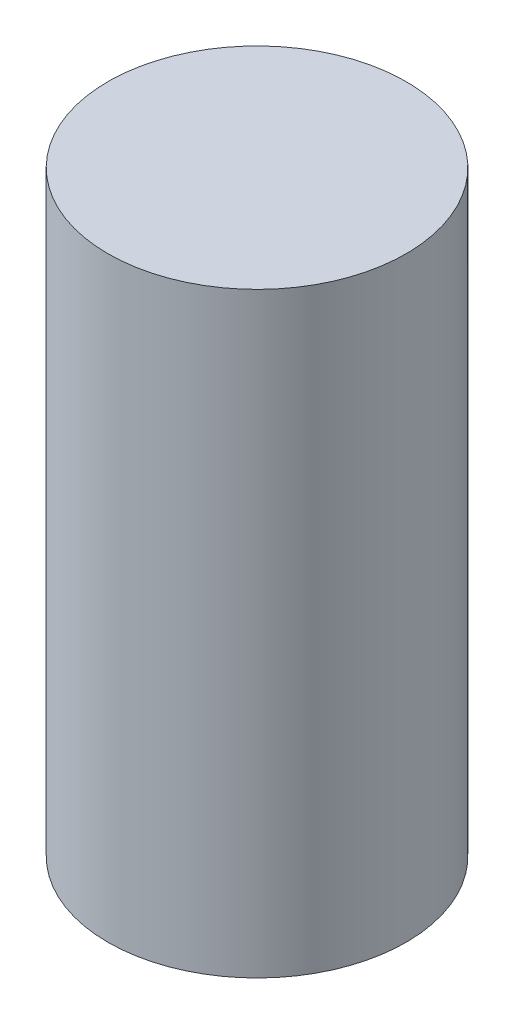
ISO-10303-21;
HEADER;
FILE_DESCRIPTION(('STEP AP214'),'2;1');
FILE_NAME('part.step','',(''),(''),'','','');
FILE_SCHEMA(('AUTOMOTIVE_DESIGN { 1 0 10303 214 1 1 1 1 }'));
ENDSEC;
DATA;
#1=APPLICATION_CONTEXT('core data for automotive mechanical design processes');
#2=APPLICATION_PROTOCOL_DEFINITION('international standard','automotive_design',2000,#1);
#3=PRODUCT_CONTEXT('',#1,'mechanical');
#4=PRODUCT('Part','Part','',(#3));
#5=PRODUCT_RELATED_PRODUCT_CATEGORY('part','',(#4));
#6=PRODUCT_DEFINITION_FORMATION('','',#4);
#7=PRODUCT_DEFINITION_CONTEXT('part definition',#1,'design');
#8=PRODUCT_DEFINITION('design','',#6,#7);
#9=PRODUCT_DEFINITION_SHAPE('','',#8);
#10=(LENGTH_UNIT() NAMED_UNIT(*) SI_UNIT(.MILLI.,.METRE.));
#11=(NAMED_UNIT(*) PLANE_ANGLE_UNIT() SI_UNIT($,.RADIAN.));
#12=(NAMED_UNIT(*) SI_UNIT($,.STERADIAN.) SOLID_ANGLE_UNIT());
#13=UNCERTAINTY_MEASURE_WITH_UNIT(LENGTH_MEASURE(1.E-05),#10,'distance_accuracy_value','');
#14=(GEOMETRIC_REPRESENTATION_CONTEXT(3) GLOBAL_UNCERTAINTY_ASSIGNED_CONTEXT((#13)) GLOBAL_UNIT_ASSIGNED_CONTEXT((#10,
#11,#12)) REPRESENTATION_CONTEXT('',''));
#15=CARTESIAN_POINT('',(0.,0.,0.));
#16=DIRECTION('',(0.,0.,1.));
#17=DIRECTION('',(1.,0.,0.));
#18=AXIS2_PLACEMENT_3D('',#15,#16,#17);
#19=CARTESIAN_POINT('',(0.,101.6,0.));
#20=DIRECTION('',(0.,-1.,0.));
#21=DIRECTION('',(0.,0.,-1.));
#22=AXIS2_PLACEMENT_3D('',#19,#20,#21);
#23=CYLINDRICAL_SURFACE('',#22,25.4);
#24=CARTESIAN_POINT('',(0.,101.6,0.));
#25=DIRECTION('',(0.,1.,0.));
#26=DIRECTION('',(0.,0.,1.));
#27=AXIS2_PLACEMENT_3D('',#24,#25,#26);
#28=CIRCLE('',#27,25.4);
#29=CARTESIAN_POINT('',(0.,101.6,25.4));
#30=VERTEX_POINT('',#29);
#31=EDGE_CURVE('E10',#30,#30,#28,.T.);
#32=ORIENTED_EDGE('',*,*,#31,.F.);
#33=EDGE_LOOP('',(#32));
#34=FACE_BOUND('',#33,.T.);
#35=CARTESIAN_POINT('',(0.,0.,0.));
#36=DIRECTION('',(0.,1.,0.));
#37=DIRECTION('',(0.,0.,1.));
#38=AXIS2_PLACEMENT_3D('',#35,#36,#37);
#39=CIRCLE('',#38,25.4);
#40=CARTESIAN_POINT('',(0.,0.,25.4));
#41=VERTEX_POINT('',#40);
#42=EDGE_CURVE('E38',#41,#41,#39,.T.);
#43=ORIENTED_EDGE('',*,*,#42,.T.);
#44=EDGE_LOOP('',(#43));
#45=FACE_BOUND('',#44,.T.);
#46=ADVANCED_FACE('F35',(#34,#45),#23,.T.);
#47=CARTESIAN_POINT('',(0.,101.6,0.));
#48=DIRECTION('',(0.,1.,0.));
#49=DIRECTION('',(0.,0.,1.));
#50=AXIS2_PLACEMENT_3D('',#47,#48,#49);
#51=PLANE('',#50);
#52=ORIENTED_EDGE('',*,*,#31,.T.);
#53=EDGE_LOOP('',(#52));
#54=FACE_BOUND('',#53,.T.);
#55=ADVANCED_FACE('F50',(#54),#51,.T.);
#56=CARTESIAN_POINT('',(0.,0.,0.));
#57=DIRECTION('',(0.,1.,0.));
#58=DIRECTION('',(0.,0.,1.));
#59=AXIS2_PLACEMENT_3D('',#56,#57,#58);
#60=PLANE('',#59);
#61=ORIENTED_EDGE('',*,*,#42,.F.);
#62=EDGE_LOOP('',(#61));
#63=FACE_BOUND('',#62,.T.);
#64=ADVANCED_FACE('F48',(#63),#60,.F.);
#65=CLOSED_SHELL('',(#46,#55,#64));
#66=MANIFOLD_SOLID_BREP('B2',#65);
#67=ADVANCED_BREP_SHAPE_REPRESENTATION('',(#18,#66),#14);
#68=SHAPE_DEFINITION_REPRESENTATION(#9,#67);
ENDSEC;
END-ISO-10303-21;
